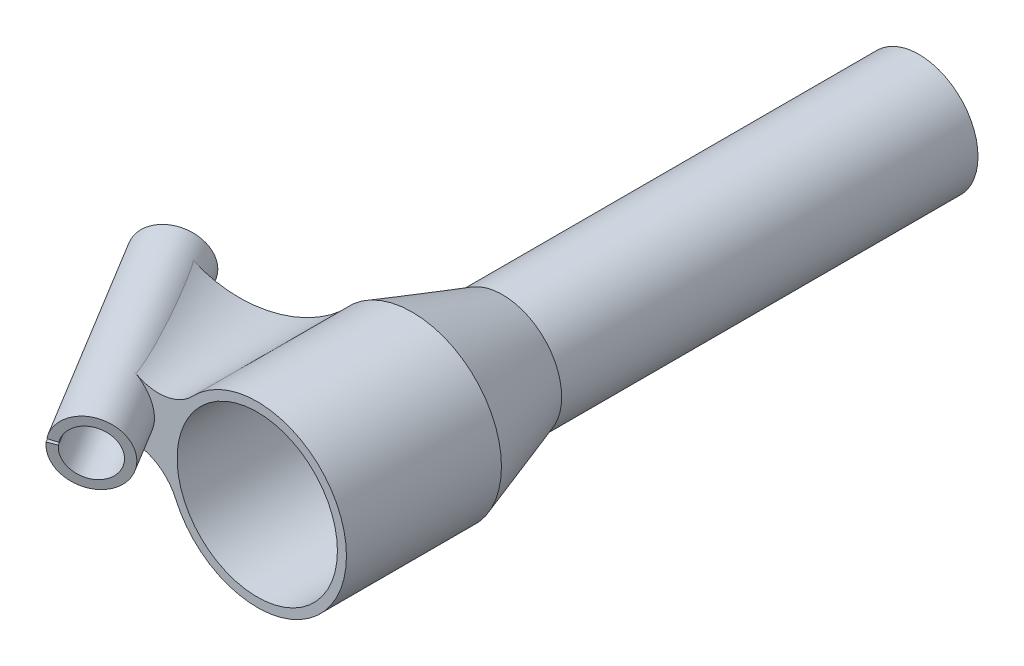
ISO-10303-21;
HEADER;
FILE_DESCRIPTION(('STEP AP214'),'2;1');
FILE_NAME('part.step','',(''),(''),'','','');
FILE_SCHEMA(('AUTOMOTIVE_DESIGN { 1 0 10303 214 1 1 1 1 }'));
ENDSEC;
DATA;
#1=APPLICATION_CONTEXT('core data for automotive mechanical design processes');
#2=APPLICATION_PROTOCOL_DEFINITION('international standard','automotive_design',2000,#1);
#3=PRODUCT_CONTEXT('',#1,'mechanical');
#4=PRODUCT('Part','Part','',(#3));
#5=PRODUCT_RELATED_PRODUCT_CATEGORY('part','',(#4));
#6=PRODUCT_DEFINITION_FORMATION('','',#4);
#7=PRODUCT_DEFINITION_CONTEXT('part definition',#1,'design');
#8=PRODUCT_DEFINITION('design','',#6,#7);
#9=PRODUCT_DEFINITION_SHAPE('','',#8);
#10=(LENGTH_UNIT() NAMED_UNIT(*) SI_UNIT(.MILLI.,.METRE.));
#11=(NAMED_UNIT(*) PLANE_ANGLE_UNIT() SI_UNIT($,.RADIAN.));
#12=(NAMED_UNIT(*) SI_UNIT($,.STERADIAN.) SOLID_ANGLE_UNIT());
#13=UNCERTAINTY_MEASURE_WITH_UNIT(LENGTH_MEASURE(1.E-05),#10,'distance_accuracy_value','');
#14=(GEOMETRIC_REPRESENTATION_CONTEXT(3) GLOBAL_UNCERTAINTY_ASSIGNED_CONTEXT((#13)) GLOBAL_UNIT_ASSIGNED_CONTEXT((#10,
#11,#12)) REPRESENTATION_CONTEXT('',''));
#15=CARTESIAN_POINT('',(0.,0.,0.));
#16=DIRECTION('',(0.,0.,1.));
#17=DIRECTION('',(1.,0.,0.));
#18=AXIS2_PLACEMENT_3D('',#15,#16,#17);
#19=CARTESIAN_POINT('',(-21.3575877374307,0.633698021464358,3.81273054215819));
#20=CARTESIAN_POINT('',(-14.683987017338,-0.896644228084365,17.));
#21=CARTESIAN_POINT('',(-20.8358609631164,0.859959942551472,3.67981004064208));
#22=CARTESIAN_POINT('',(-14.4189044379876,-0.855368175709342,17.));
#23=CARTESIAN_POINT('',(-20.2773212147006,1.04752006748351,3.53485155300601));
#24=CARTESIAN_POINT('',(-14.1433826197521,-0.833619817759401,17.));
#25=CARTESIAN_POINT('',(-19.1042223535504,1.31840552432742,3.22441051803164));
#26=CARTESIAN_POINT('',(-13.5814100552585,-0.834497384192288,17.));
#27=CARTESIAN_POINT('',(-18.4897041398732,1.40152699581741,3.05892933704576));
#28=CARTESIAN_POINT('',(-13.2949593090003,-0.857123308575115,17.));
#29=CARTESIAN_POINT('',(-17.2333468820839,1.44234478903316,2.71432910008326));
#30=CARTESIAN_POINT('',(-12.7210784382082,-0.952068333156142,17.));
#31=CARTESIAN_POINT('',(-16.5916679278792,1.39986734426265,2.53524575495671));
#32=CARTESIAN_POINT('',(-12.4340309661871,-1.02459199416444,17.));
#33=CARTESIAN_POINT('',(-15.3179205075513,1.1802374597193,2.17317933315417));
#34=CARTESIAN_POINT('',(-11.8721369115406,-1.21768763518036,17.));
#35=CARTESIAN_POINT('',(-14.686097283572,1.00302538721672,1.99026100965571));
#36=CARTESIAN_POINT('',(-11.5972903289152,-1.33825961518798,17.));
#37=CARTESIAN_POINT('',(-13.4709470755427,0.520427405898755,1.63156810432924));
#38=CARTESIAN_POINT('',(-11.0722130157059,-1.6253979157663,17.));
#39=CARTESIAN_POINT('',(-12.8878605954999,0.215137013462833,1.45586451543737));
#40=CARTESIAN_POINT('',(-10.8223949985682,-1.79173854416832,17.));
#41=CARTESIAN_POINT('',(-11.803355709349,-0.501815094100621,1.1218125761399));
#42=CARTESIAN_POINT('',(-10.3566285702611,-2.16061859172914,17.));
#43=CARTESIAN_POINT('',(-11.302078727206,-0.913263611710757,0.963513610207532));
#44=CARTESIAN_POINT('',(-10.1406801590917,-2.36315801088794,17.));
#45=CARTESIAN_POINT('',(-10.4025882567342,-1.81027823953436,0.671742080139232));
#46=CARTESIAN_POINT('',(-9.75108126975601,-2.79509147449339,17.));
#47=CARTESIAN_POINT('',(-10.0043779409748,-2.29560574341421,0.538281997625108));
#48=CARTESIAN_POINT('',(-9.57746504324554,-3.02405297426646,17.));
#49=CARTESIAN_POINT('',(-9.31838993621809,-3.30482919555537,0.299950325505213));
#50=CARTESIAN_POINT('',(-9.27348962190352,-3.4967186876267,17.));
#51=CARTESIAN_POINT('',(-9.03050762872951,-3.82854658962447,0.195058560589281));
#52=CARTESIAN_POINT('',(-9.14313042707197,-3.74042290121387,17.));
#53=CARTESIAN_POINT('',(-8.79535934711773,-4.35540210949988,0.104561651660663));
#54=CARTESIAN_POINT('',(-9.03484504576196,-3.98587506064481,17.));
#55=B_SPLINE_SURFACE_WITH_KNOTS('',3,1,((#19,#20),(#21,#22),(#23,#24),(#25,#26),(#27,#28),(#29,
#30),(#31,#32),(#33,#34),(#35,#36),(#37,#38),(#39,#40),(#41,#42),(#43,#44),(#45,#46),(#47,#48),
(#49,#50),(#51,#52),(#53,#54)),.UNSPECIFIED.,.F.,.F.,.F.,(4,2,2,2,2,2,2,2,4),(2,2),(0.,0.125,
0.25,0.375,0.5,0.625,0.75,0.875,1.),(0.,1.),.UNSPECIFIED.);
#56=CARTESIAN_POINT('',(-13.8707629595306,-6.11932223214418,17.));
#57=DIRECTION('',(0.,0.,-1.));
#58=DIRECTION('',(-1.,0.,0.));
#59=AXIS2_PLACEMENT_3D('',#56,#57,#58);
#60=CIRCLE('',#59,5.28561244344371);
#61=CARTESIAN_POINT('',(-14.683987017338,-0.896644228084365,17.));
#62=VERTEX_POINT('',#61);
#63=CARTESIAN_POINT('',(-9.03484504576196,-3.98587506064481,17.));
#64=VERTEX_POINT('',#63);
#65=EDGE_CURVE('E305',#62,#64,#60,.T.);
#66=CARTESIAN_POINT('',(-14.6839870173368,-0.896644228084656,17.0000000000025));
#67=CARTESIAN_POINT('',(-14.6833096345769,-0.89653885038281,17.0000005147996));
#68=CARTESIAN_POINT('',(-14.6826319208549,-0.896423925065205,16.9999515519792));
#69=CARTESIAN_POINT('',(-14.6812987528756,-0.896176345628803,16.9997433088099));
#70=CARTESIAN_POINT('',(-14.6806432598139,-0.896043724650004,16.9995842324017));
#71=CARTESIAN_POINT('',(-14.6787387919233,-0.895620328837586,16.9989240012649));
#72=CARTESIAN_POINT('',(-14.6775538317352,-0.895304320398823,16.9982397792249));
#73=CARTESIAN_POINT('',(-14.6752761239711,-0.894585498919072,16.9963460535506));
#74=CARTESIAN_POINT('',(-14.6742573517727,-0.894178579631031,16.9950554838133));
#75=CARTESIAN_POINT('',(-14.6719445734761,-0.893087070815295,16.991255791844));
#76=CARTESIAN_POINT('',(-14.6710062555261,-0.892420224660089,16.9885524889933));
#77=CARTESIAN_POINT('',(-14.6691966522356,-0.890755500264559,16.9813778561304));
#78=CARTESIAN_POINT('',(-14.6687105139977,-0.889801883201113,16.9768277781528));
#79=CARTESIAN_POINT('',(-14.6682634926754,-0.887964095042097,16.9676706709796));
#80=CARTESIAN_POINT('',(-14.6683064846804,-0.887080484041967,16.9630634687813));
#81=CARTESIAN_POINT('',(-14.6689404663162,-0.884227085165791,16.947796494647));
#82=CARTESIAN_POINT('',(-14.6701781868697,-0.882358238271274,16.9371508591288));
#83=CARTESIAN_POINT('',(-14.6732935023905,-0.878729470918932,16.9159320915969));
#84=CARTESIAN_POINT('',(-14.675172609621,-0.876969819617939,16.9053591917383));
#85=CARTESIAN_POINT('',(-14.679328631119,-0.873522655757762,16.8842869622885));
#86=CARTESIAN_POINT('',(-14.6816052163044,-0.871835084948702,16.8737875792521));
#87=CARTESIAN_POINT('',(-14.6864159152195,-0.868509583118143,16.8528565331742));
#88=CARTESIAN_POINT('',(-14.6889496989065,-0.866871591894926,16.8424248011704));
#89=CARTESIAN_POINT('',(-14.6967926663831,-0.862033753100477,16.811352488329));
#90=CARTESIAN_POINT('',(-14.7023780314482,-0.858884131716276,16.7907738071003));
#91=CARTESIAN_POINT('',(-14.7140035296533,-0.852667063773139,16.7497321836674));
#92=CARTESIAN_POINT('',(-14.7200437320058,-0.849599629817335,16.7292692595893));
#93=CARTESIAN_POINT('',(-14.7386494097393,-0.840476815463713,16.6679777744917));
#94=CARTESIAN_POINT('',(-14.7516905598197,-0.834506244287884,16.6272812708536));
#95=CARTESIAN_POINT('',(-14.7785063624901,-0.822699803892735,16.5461650807744));
#96=CARTESIAN_POINT('',(-14.7922802030083,-0.816863795411578,16.5057451416805));
#97=CARTESIAN_POINT('',(-14.820355313055,-0.805281827983421,16.4250960718656));
#98=CARTESIAN_POINT('',(-14.8346563525123,-0.799535831279117,16.3848668663594));
#99=CARTESIAN_POINT('',(-14.8781230690595,-0.782405041018454,16.2644768776261));
#100=CARTESIAN_POINT('',(-14.9078846665009,-0.771113673672471,16.1845183576079));
#101=CARTESIAN_POINT('',(-14.9684814275806,-0.748688823277761,16.0249857005847));
#102=CARTESIAN_POINT('',(-14.999316639472,-0.737555347357139,15.94541158104));
#103=CARTESIAN_POINT('',(-15.0930612710859,-0.704323822297415,15.7071008447505));
#104=CARTESIAN_POINT('',(-15.1571930827404,-0.682401016495542,15.5488207226027));
#105=CARTESIAN_POINT('',(-15.2877360232498,-0.638883912495943,15.2330995830573));
#106=CARTESIAN_POINT('',(-15.3541479246888,-0.617289729297851,15.0756588713833));
#107=CARTESIAN_POINT('',(-15.4887738726566,-0.574403857208613,14.761534363399));
#108=CARTESIAN_POINT('',(-15.5569876816302,-0.5531121290067,14.6048504705031));
#109=CARTESIAN_POINT('',(-15.7638112876265,-0.489689583232204,14.1359297914063));
#110=CARTESIAN_POINT('',(-15.9046833122008,-0.447985042618774,13.8246326804412));
#111=CARTESIAN_POINT('',(-16.1911336680287,-0.365713047436176,13.2040398244052));
#112=CARTESIAN_POINT('',(-16.3367123636683,-0.325145681362105,12.8947442365257));
#113=CARTESIAN_POINT('',(-16.6317869700799,-0.245196584357963,12.2779486398361));
#114=CARTESIAN_POINT('',(-16.7812821273131,-0.205814628439816,11.970448299337));
#115=CARTESIAN_POINT('',(-17.0837046293477,-0.128269533741429,11.3569978652814));
#116=CARTESIAN_POINT('',(-17.236631882484,-0.0901063624754313,11.0510477305886));
#117=CARTESIAN_POINT('',(-17.5408475110017,-0.0161941939414938,10.4499261148993));
#118=CARTESIAN_POINT('',(-17.6920422449584,0.0195929484158165,10.1547119009627));
#119=CARTESIAN_POINT('',(-17.9971541550771,0.0899293965904333,9.56554302468293));
#120=CARTESIAN_POINT('',(-18.1510713517045,0.124478693096662,9.27158837182882));
#121=CARTESIAN_POINT('',(-18.4615428504602,0.192263973805205,8.68492774540301));
#122=CARTESIAN_POINT('',(-18.6180971201771,0.225499974132131,8.39222175653963));
#123=CARTESIAN_POINT('',(-18.9338866840801,0.290543015493119,7.80809976789996));
#124=CARTESIAN_POINT('',(-19.0931219694258,0.322350061237791,7.51668376387403));
#125=CARTESIAN_POINT('',(-19.3626026862382,0.374315026876908,7.02921307472413));
#126=CARTESIAN_POINT('',(-19.4720548634016,0.394916536812497,6.83276692600762));
#127=CARTESIAN_POINT('',(-19.6924676128203,0.435259092950596,6.44063537596576));
#128=CARTESIAN_POINT('',(-19.8034281680439,0.455000148858228,6.24494996608267));
#129=CARTESIAN_POINT('',(-19.9897559435148,0.487010388998307,5.91979858442793));
#130=CARTESIAN_POINT('',(-20.0646172916767,0.499570611219422,5.79007153685656));
#131=CARTESIAN_POINT('',(-20.2153127675313,0.524131628968631,5.53113080365514));
#132=CARTESIAN_POINT('',(-20.2911468938568,0.536132425282944,5.40191711730384));
#133=CARTESIAN_POINT('',(-20.4691944977303,0.563273896020047,5.10171536575768));
#134=CARTESIAN_POINT('',(-20.5718741179016,0.578147742157589,4.93097765930691));
#135=CARTESIAN_POINT('',(-20.7456462979657,0.60124007567977,4.64853300087943));
#136=CARTESIAN_POINT('',(-20.8157572859132,0.610015324298854,4.53627134825222));
#137=CARTESIAN_POINT('',(-20.934619433342,0.623353294252596,4.350855391479));
#138=CARTESIAN_POINT('',(-20.9826189226933,0.628339861843105,4.27725370737928));
#139=CARTESIAN_POINT('',(-21.0642005380292,0.635645868208012,4.15593896600036));
#140=CARTESIAN_POINT('',(-21.0971945787452,0.63829798445849,4.10785433747714));
#141=CARTESIAN_POINT('',(-21.1534591669779,0.641915517475975,4.02881330350557));
#142=CARTESIAN_POINT('',(-21.1762630474354,0.643148182711897,3.99754119546337));
#143=CARTESIAN_POINT('',(-21.2153114169263,0.644549185757133,3.94632848136886));
#144=CARTESIAN_POINT('',(-21.2311830237004,0.644936038304183,3.92611360635662));
#145=CARTESIAN_POINT('',(-21.2584984204423,0.645040340473407,3.89318102150382));
#146=CARTESIAN_POINT('',(-21.2696432623365,0.644938696601926,3.8802214238355));
#147=CARTESIAN_POINT('',(-21.2889401716285,0.644311673467968,3.85927997309506));
#148=CARTESIAN_POINT('',(-21.2968531392506,0.643938653002924,3.85107748692121));
#149=CARTESIAN_POINT('',(-21.3106560374961,0.642923988943016,3.83798119293023));
#150=CARTESIAN_POINT('',(-21.3163555565077,0.64241101500363,3.83288633632638));
#151=CARTESIAN_POINT('',(-21.325256982123,0.641335392267976,3.82584460081664));
#152=CARTESIAN_POINT('',(-21.3282516463143,0.640931256714719,3.82361654831303));
#153=CARTESIAN_POINT('',(-21.3344220919699,0.639964060684078,3.81947460963396));
#154=CARTESIAN_POINT('',(-21.3375972133184,0.639401553001115,3.81755966667091));
#155=CARTESIAN_POINT('',(-21.3434999910031,0.638150064396229,3.81468708454539));
#156=CARTESIAN_POINT('',(-21.346177019594,0.637514302313592,3.81361213416414));
#157=CARTESIAN_POINT('',(-21.350994656633,0.636135962188615,3.81246080357126));
#158=CARTESIAN_POINT('',(-21.3530967138394,0.635462618559479,3.81219900535586));
#159=CARTESIAN_POINT('',(-21.3559640148895,0.634377585244837,3.81239923888241));
#160=CARTESIAN_POINT('',(-21.3567854846518,0.634046268309226,3.8125250647891));
#161=CARTESIAN_POINT('',(-21.3575877374307,0.633698021464358,3.81273054215819));
#162=B_SPLINE_CURVE_WITH_KNOTS('',3,(#66,#67,#68,#69,#70,#71,#72,#73,#74,#75,#76,#77,#78,#79,
#80,#81,#82,#83,#84,#85,#86,#87,#88,#89,#90,#91,#92,#93,#94,#95,#96,#97,#98,#99,#100,#101,#102,
#103,#104,#105,#106,#107,#108,#109,#110,#111,#112,#113,#114,#115,#116,#117,#118,#119,#120,#121,
#122,#123,#124,#125,#126,#127,#128,#129,#130,#131,#132,#133,#134,#135,#136,#137,#138,#139,#140,
#141,#142,#143,#144,#145,#146,#147,#148,#149,#150,#151,#152,#153,#154,#155,#156,#157,#158,#159,
#160,#161),.UNSPECIFIED.,.F.,.F.,(4,2,2,2,2,2,2,2,2,2,2,2,2,2,2,2,2,2,2,2,2,2,2,2,2,2,2,2,2,2,2,
2,2,2,2,2,2,2,2,2,2,2,2,2,2,2,2,4),(0.,0.00205705355248964,0.00411030740455365,
0.00822253345640406,0.0132146073804585,0.0219068107503364,0.0358660650164819,0.0499276104467232,
0.0824948613777941,0.115139436052746,0.147757110507623,0.180333446041185,0.244986407110505,
0.309649226374192,0.43908403549571,0.568378260146092,0.697616713271743,0.95578879199716,
1.21397248918976,1.73048464469141,2.24717357644492,2.76379472692419,3.79640995482804,
4.82910531916876,5.86160342836744,6.89407399412374,7.89487135984693,8.89567625198916,
9.89646885245799,10.8972581535288,11.5747160137562,12.2521662309089,12.7030718118788,
13.1539767591258,13.7533118663737,14.151227041545,14.4152371736476,14.5903424348968,
14.7064878567027,14.7835770214339,14.8348279610279,14.8690140350615,14.8919584417024,
14.9032110349845,14.9144248281674,14.9232268894807,14.9297710614318,14.9324497834166),.UNSPECIFIED.);
#163=CARTESIAN_POINT('',(-21.3575877374297,0.633698021464116,3.81273054216025));
#164=VERTEX_POINT('',#163);
#165=EDGE_CURVE('E205',#62,#164,#162,.T.);
#166=CARTESIAN_POINT('',(-17.681244562606,-8.70609177790614,2.34424287881773));
#167=DIRECTION('',(0.265640259417945,-0.0468395448977797,0.962933699488255));
#168=DIRECTION('',(-0.963991751594857,0.,0.265932139571506));
#169=AXIS2_PLACEMENT_3D('',#166,#167,#168);
#170=CIRCLE('',#169,10.1441425784977);
#171=CARTESIAN_POINT('',(-9.2481142616234,-3.46237017635689,0.272900491973125));
#172=VERTEX_POINT('',#171);
#173=EDGE_CURVE('E335',#172,#164,#170,.T.);
#174=CARTESIAN_POINT('',(-9.03484504576196,-3.98587506064481,17.));
#175=CARTESIAN_POINT('',(-9.03555124928396,-3.98427433699155,17.000012805153));
#176=CARTESIAN_POINT('',(-9.03622862057589,-3.98273775211461,16.9996773547566));
#177=CARTESIAN_POINT('',(-9.03770681492541,-3.97938244390029,16.9983396717478));
#178=CARTESIAN_POINT('',(-9.03848397186105,-3.97761677980426,16.997168026878));
#179=CARTESIAN_POINT('',(-9.04047571961812,-3.97308879059006,16.9933241176221));
#180=CARTESIAN_POINT('',(-9.04152821458961,-3.97069242359235,16.9902082734842));
#181=CARTESIAN_POINT('',(-9.04407729661022,-3.96488415471948,16.9813080970583));
#182=CARTESIAN_POINT('',(-9.04536001287796,-3.96195608053107,16.9751975197101));
#183=CARTESIAN_POINT('',(-9.04765596733559,-3.95671001494612,16.9626476930363));
#184=CARTESIAN_POINT('',(-9.04866725692749,-3.95439643624192,16.9562064429341));
#185=CARTESIAN_POINT('',(-9.05070156964881,-3.94973845040568,16.9419464645801));
#186=CARTESIAN_POINT('',(-9.05169050818354,-3.9474712652573,16.9340979894712));
#187=CARTESIAN_POINT('',(-9.05352787532859,-3.94325539888562,16.9182984420906));
#188=CARTESIAN_POINT('',(-9.05437621476025,-3.94130691982015,16.9103473081244));
#189=CARTESIAN_POINT('',(-9.05677982296039,-3.93578209385609,16.8863796836763));
#190=CARTESIAN_POINT('',(-9.05819054892718,-3.93253354023937,16.8702737879489));
#191=CARTESIAN_POINT('',(-9.06079292424214,-3.92653370085804,16.8379797226559));
#192=CARTESIAN_POINT('',(-9.06198485831286,-3.92378176889994,16.8217916885967));
#193=CARTESIAN_POINT('',(-9.06421949295347,-3.91861683204985,16.7893708077852));
#194=CARTESIAN_POINT('',(-9.06526236389694,-3.9162034402788,16.7731380341618));
#195=CARTESIAN_POINT('',(-9.06822063489275,-3.90935089634458,16.7245998405629));
#196=CARTESIAN_POINT('',(-9.06998187671124,-3.90526201245881,16.6922362655119));
#197=CARTESIAN_POINT('',(-9.07325260012768,-3.89765684692302,16.6274279745547));
#198=CARTESIAN_POINT('',(-9.07476205076957,-3.89414063568059,16.5949832491685));
#199=CARTESIAN_POINT('',(-9.07903395841246,-3.88417566700305,16.4975309244135));
#200=CARTESIAN_POINT('',(-9.08153740357911,-3.87831653572407,16.4324521883477));
#201=CARTESIAN_POINT('',(-9.08615054185665,-3.86749618594238,16.3022631633205));
#202=CARTESIAN_POINT('',(-9.08826054943453,-3.86253425042552,16.237152941624));
#203=CARTESIAN_POINT('',(-9.09221253120222,-3.85322226234022,16.1069043637876));
#204=CARTESIAN_POINT('',(-9.09405460136123,-3.84887199070612,16.0417660261443));
#205=CARTESIAN_POINT('',(-9.09929311249016,-3.83647900431961,15.8464589997294));
#206=CARTESIAN_POINT('',(-9.10240694757589,-3.82908214103635,15.716242307209));
#207=CARTESIAN_POINT('',(-9.1081795441421,-3.81533017475622,15.4557428615065));
#208=CARTESIAN_POINT('',(-9.11083829408403,-3.80897509817373,15.3254601067333));
#209=CARTESIAN_POINT('',(-9.11835446648362,-3.79096416622809,14.9345034951141));
#210=CARTESIAN_POINT('',(-9.12275058454824,-3.78036552356855,14.6737725054087));
#211=CARTESIAN_POINT('',(-9.1308644115713,-3.76072455500859,14.1522118502829));
#212=CARTESIAN_POINT('',(-9.13458203477052,-3.75168242585388,13.8913821765585));
#213=CARTESIAN_POINT('',(-9.14156434939976,-3.73463665259865,13.3697047750198));
#214=CARTESIAN_POINT('',(-9.144829078624,-3.7266329218469,13.1088570505316));
#215=CARTESIAN_POINT('',(-9.15418095270983,-3.7036297793616,12.3241527156124));
#216=CARTESIAN_POINT('',(-9.15979537389429,-3.68971234845334,11.8002592255882));
#217=CARTESIAN_POINT('',(-9.17030442280596,-3.66351425234824,10.7524091512062));
#218=CARTESIAN_POINT('',(-9.17519902778602,-3.65123363887819,10.2284525653779));
#219=CARTESIAN_POINT('',(-9.18450522129588,-3.62776078935247,9.18058421898254));
#220=CARTESIAN_POINT('',(-9.18891687731661,-3.61656840124452,8.65667246240206));
#221=CARTESIAN_POINT('',(-9.1973966876382,-3.59494832487964,7.60883563949249));
#222=CARTESIAN_POINT('',(-9.20146484525126,-3.58452062924926,7.08491057334049));
#223=CARTESIAN_POINT('',(-9.2093410145221,-3.56423643710706,6.03701547157483));
#224=CARTESIAN_POINT('',(-9.21314901027826,-3.55437997551581,5.51304543516885));
#225=CARTESIAN_POINT('',(-9.22055935913035,-3.53511194926927,4.46509404125408));
#226=CARTESIAN_POINT('',(-9.22416171154953,-3.52570038607811,3.9411126837137));
#227=CARTESIAN_POINT('',(-9.23119922348339,-3.50723305294247,2.89308013462641));
#228=CARTESIAN_POINT('',(-9.23463436302263,-3.49817732553131,2.36902894219865));
#229=CARTESIAN_POINT('',(-9.24136255067154,-3.48036392928466,1.32092247875146));
#230=CARTESIAN_POINT('',(-9.2446555992978,-3.47160625936558,0.796867207753782));
#231=CARTESIAN_POINT('',(-9.24789039518241,-3.46296812556695,0.272809649157695));
#232=B_SPLINE_CURVE_WITH_KNOTS('',3,(#174,#175,#176,#177,#178,#179,#180,#181,#182,#183,#184,
#185,#186,#187,#188,#189,#190,#191,#192,#193,#194,#195,#196,#197,#198,#199,#200,#201,#202,#203,
#204,#205,#206,#207,#208,#209,#210,#211,#212,#213,#214,#215,#216,#217,#218,#219,#220,#221,#222,
#223,#224,#225,#226,#227,#228,#229,#230,#231),.UNSPECIFIED.,.F.,.F.,(4,2,2,2,2,2,2,2,2,2,2,2,2,
2,2,2,2,2,2,2,2,2,2,2,2,2,2,2,4),(0.,0.0051043895513909,0.0117353636084539,0.023789698444097,
0.0443866786099016,0.0651277945227576,0.0897989297350008,0.114485653863565,0.163937028495885,
0.213323586673136,0.26265323859055,0.360646788124654,0.458652376458069,0.654805873280934,
0.850801910015572,1.04672757155133,1.43810935409454,1.82950105854139,2.6124383918584,
3.39547461711148,4.1784454582589,5.75076436331212,7.32313294508229,8.8952815109849,
10.4674149156507,12.0396443265354,13.6118789112114,15.1843008581927,16.7567170880193),.UNSPECIFIED.);
#233=EDGE_CURVE('E271',#64,#172,#232,.T.);
#234=ORIENTED_EDGE('',*,*,#65,.F.);
#235=ORIENTED_EDGE('',*,*,#165,.T.);
#236=ORIENTED_EDGE('',*,*,#173,.F.);
#237=ORIENTED_EDGE('',*,*,#233,.F.);
#238=EDGE_LOOP('',(#234,#235,#236,#237));
#239=FACE_BOUND('',#238,.T.);
#240=ADVANCED_FACE('F86',(#239),#55,.T.);
#241=CARTESIAN_POINT('',(-6.77529902191482,7.10092928735438,0.104561651660665));
#242=CARTESIAN_POINT('',(-7.12672765992668,6.83559637933924,17.));
#243=CARTESIAN_POINT('',(-7.17646132735561,6.68627249208677,0.195058560589282));
#244=CARTESIAN_POINT('',(-7.31243221643085,6.64198257800174,17.));
#245=CARTESIAN_POINT('',(-7.62610410553911,6.29260066957099,0.299950325505214));
#246=CARTESIAN_POINT('',(-7.51828153992581,6.45756099733955,17.));
#247=CARTESIAN_POINT('',(-8.61589672130559,5.57886255457645,0.538281997625109));
#248=CARTESIAN_POINT('',(-7.9655861952898,6.1173662315713,17.));
#249=CARTESIAN_POINT('',(-9.1560837989824,5.25899982978589,0.671742080139233));
#250=CARTESIAN_POINT('',(-8.20704152715882,5.96159304646525,17.));
#251=CARTESIAN_POINT('',(-10.3081254281255,4.72372566291389,0.963513610207534));
#252=CARTESIAN_POINT('',(-8.72087467366345,5.68895902601483,17.));
#253=CARTESIAN_POINT('',(-10.9198953901792,4.50853735236073,1.1218125761399));
#254=CARTESIAN_POINT('',(-8.99307236327952,5.57249293495213,17.));
#255=CARTESIAN_POINT('',(-12.184208691488,4.20574526402518,1.45586451543737));
#256=CARTESIAN_POINT('',(-9.55691404570624,5.38516057686995,17.));
#257=CARTESIAN_POINT('',(-12.8365462178411,4.11829345653179,1.63156810432925));
#258=CARTESIAN_POINT('',(-9.8485580385169,5.31429430985047,17.));
#259=CARTESIAN_POINT('',(-14.1434721322117,4.08040554299353,1.99026100965571));
#260=CARTESIAN_POINT('',(-10.4401763977998,5.2240595855729,17.));
#261=CARTESIAN_POINT('',(-14.7978018518626,4.12997693577059,2.17317933315418));
#262=CARTESIAN_POINT('',(-10.7396857492244,5.2047620532683,17.));
#263=CARTESIAN_POINT('',(-16.0698507480799,4.35923962922238,2.53524575495672));
#264=CARTESIAN_POINT('',(-11.333736044855,5.21549058940375,17.));
#265=CARTESIAN_POINT('',(-16.6873598680082,4.53879101570784,2.71432910008327));
#266=CARTESIAN_POINT('',(-11.628276989061,5.24551665784381,17.));
#267=CARTESIAN_POINT('',(-17.8539890047378,5.0068466841668,3.05892933704576));
#268=CARTESIAN_POINT('',(-12.2000217194698,5.35257633654486,17.));
#269=CARTESIAN_POINT('',(-18.4030180178763,5.29513292507291,3.22441051803165));
#270=CARTESIAN_POINT('',(-12.4769358938476,5.42928684765484,17.));
#271=CARTESIAN_POINT('',(-19.4127220783769,5.95090543057311,3.53485155300601));
#272=CARTESIAN_POINT('',(-13.0053175111836,5.62066814200681,17.));
#273=CARTESIAN_POINT('',(-19.8734284175674,6.31818614073169,3.67981004064208));
#274=CARTESIAN_POINT('',(-13.2567849541418,5.73533892524881,17.));
#275=CARTESIAN_POINT('',(-20.2863050827777,6.70924386446993,3.81273054215819));
#276=CARTESIAN_POINT('',(-13.4917638565071,5.86478930886338,17.));
#277=B_SPLINE_SURFACE_WITH_KNOTS('',3,1,((#241,#242),(#243,#244),(#245,#246),(#247,#248),(#249,
#250),(#251,#252),(#253,#254),(#255,#256),(#257,#258),(#259,#260),(#261,#262),(#263,#264),(#265,
#266),(#267,#268),(#269,#270),(#271,#272),(#273,#274),(#275,#276)),.UNSPECIFIED.,.F.,.F.,.F.,(4,
2,2,2,2,2,2,2,4),(2,2),(0.,0.125,0.25,0.375,0.5,0.625,0.75,0.875,1.),(0.,1.),.UNSPECIFIED.);
#278=CARTESIAN_POINT('',(-13.6372762841059,14.228391999062,2.34424287881773));
#279=DIRECTION('',(0.265640259417945,-0.0468395448977797,0.962933699488255));
#280=DIRECTION('',(-0.963991751594857,0.,0.265932139571506));
#281=AXIS2_PLACEMENT_3D('',#278,#279,#280);
#282=CIRCLE('',#281,10.1441425784977);
#283=CARTESIAN_POINT('',(-20.2863050827777,6.70924386446993,3.81273054215819));
#284=VERTEX_POINT('',#283);
#285=CARTESIAN_POINT('',(-7.50593526738699,6.41689647068539,0.272845943762579));
#286=VERTEX_POINT('',#285);
#287=EDGE_CURVE('E327',#284,#286,#282,.T.);
#288=CARTESIAN_POINT('',(-20.2863050827778,6.70924386446994,3.81273054215803));
#289=CARTESIAN_POINT('',(-20.2847592380986,6.7077935044939,3.81227067736124));
#290=CARTESIAN_POINT('',(-20.2831453611308,6.70643483050747,3.81221590466666));
#291=CARTESIAN_POINT('',(-20.2790149983236,6.70322275835533,3.81280075072131));
#292=CARTESIAN_POINT('',(-20.2764613863428,6.70147454667346,3.81381218855733));
#293=CARTESIAN_POINT('',(-20.2703360130604,6.69753238603535,3.81692466123508));
#294=CARTESIAN_POINT('',(-20.2668459261124,6.69551174792934,3.81931397933045));
#295=CARTESIAN_POINT('',(-20.2600290543751,6.69177430569509,3.82455174829591));
#296=CARTESIAN_POINT('',(-20.2567030741508,6.69005890813544,3.82740221470219));
#297=CARTESIAN_POINT('',(-20.2461357873479,6.68481431648778,3.8370187366743));
#298=CARTESIAN_POINT('',(-20.2391506063928,6.6816719784036,3.84425935377143));
#299=CARTESIAN_POINT('',(-20.2254945979577,6.67581870291725,3.85920252247386));
#300=CARTESIAN_POINT('',(-20.2188245854742,6.67310884502791,3.8669061659061));
#301=CARTESIAN_POINT('',(-20.2056894745357,6.66796458749379,3.88259783656166));
#302=CARTESIAN_POINT('',(-20.1992246940169,6.66553060153027,3.89058626786111));
#303=CARTESIAN_POINT('',(-20.1864551079853,6.66085546153611,3.90672400065974));
#304=CARTESIAN_POINT('',(-20.1801500956306,6.65861404814274,3.91487306701737));
#305=CARTESIAN_POINT('',(-20.161525401353,6.65213983635448,3.93934100803051));
#306=CARTESIAN_POINT('',(-20.1493688265813,6.64810894794134,3.95583728750845));
#307=CARTESIAN_POINT('',(-20.12533541986,6.64038627541908,3.98911155913699));
#308=CARTESIAN_POINT('',(-20.1134586419387,6.63669455641034,4.005889604642));
#309=CARTESIAN_POINT('',(-20.0781040331839,6.62596936788838,4.05654037023558));
#310=CARTESIAN_POINT('',(-20.0549257393534,6.61929378530028,4.09069746174994));
#311=CARTESIAN_POINT('',(-20.0090997357734,6.60652123569518,4.15935713423406));
#312=CARTESIAN_POINT('',(-19.9864509831738,6.60042304371565,4.19385880392941));
#313=CARTESIAN_POINT('',(-19.9415042867525,6.58862708088029,4.26313159528377));
#314=CARTESIAN_POINT('',(-19.9192061673802,6.58292910435234,4.29790256819401));
#315=CARTESIAN_POINT('',(-19.8527546858596,6.56629032165027,4.40241559780636));
#316=CARTESIAN_POINT('',(-19.808974498138,6.5557857995903,4.47246371837385));
#317=CARTESIAN_POINT('',(-19.7220595589479,6.5355326717292,4.61306927521134));
#318=CARTESIAN_POINT('',(-19.6789248407359,6.52578410476963,4.68362673744836));
#319=CARTESIAN_POINT('',(-19.5501955628068,6.49735714026939,4.8958812141307));
#320=CARTESIAN_POINT('',(-19.4653043168468,6.47950433812623,5.03811489644763));
#321=CARTESIAN_POINT('',(-19.2966650431188,6.44520236197527,5.32354559798238));
#322=CARTESIAN_POINT('',(-19.2129177887074,6.42875410149105,5.46674317979308));
#323=CARTESIAN_POINT('',(-19.0463468839117,6.3969416064566,5.7537648697621));
#324=CARTESIAN_POINT('',(-18.9635230973402,6.38157721023593,5.89758888106901));
#325=CARTESIAN_POINT('',(-18.7162838777174,6.3368140796553,6.32959078302865));
#326=CARTESIAN_POINT('',(-18.5529643448184,6.30871834172896,6.6185307895044));
#327=CARTESIAN_POINT('',(-18.228598968488,6.25520032110894,7.19795227795974));
#328=CARTESIAN_POINT('',(-18.0675532874479,6.22977822853093,7.48843386801651));
#329=CARTESIAN_POINT('',(-17.7475765394383,6.18127655663572,8.07063114047377));
#330=CARTESIAN_POINT('',(-17.5886448074597,6.15819622473822,8.3623463948119));
#331=CARTESIAN_POINT('',(-17.2727949080205,6.1141978113222,8.94701788431951));
#332=CARTESIAN_POINT('',(-17.1158766930028,6.09327967865218,9.23997408996085));
#333=CARTESIAN_POINT('',(-16.7996398131243,6.05296694091463,9.83556355594109));
#334=CARTESIAN_POINT('',(-16.6403816535977,6.03363335144262,10.1382330845334));
#335=CARTESIAN_POINT('',(-16.3242386783409,5.99717950883613,10.7449458585557));
#336=CARTESIAN_POINT('',(-16.167353882356,5.98005927410672,11.0489891153871));
#337=CARTESIAN_POINT('',(-15.8562454220669,5.94808678626318,11.6585566356624));
#338=CARTESIAN_POINT('',(-15.702021776997,5.93323454953568,11.9640809097904));
#339=CARTESIAN_POINT('',(-15.3966561070536,5.90590705242343,12.5767737524511));
#340=CARTESIAN_POINT('',(-15.2455140718807,5.89343178409318,12.883942315484));
#341=CARTESIAN_POINT('',(-14.9882349816727,5.87414420330745,13.4149547208435));
#342=CARTESIAN_POINT('',(-14.8812122476992,5.86671994362667,13.6383472800732));
#343=CARTESIAN_POINT('',(-14.6694645715334,5.85333237717816,14.0862597888623));
#344=CARTESIAN_POINT('',(-14.5647395807553,5.84736903949213,14.31077971446));
#345=CARTESIAN_POINT('',(-14.3957152036163,5.83897219434147,14.6792139312467));
#346=CARTESIAN_POINT('',(-14.330572532301,5.83604385631313,14.8227299512071));
#347=CARTESIAN_POINT('',(-14.2016595164805,5.83095665178981,15.1103900022832));
#348=CARTESIAN_POINT('',(-14.13788916605,5.82879778197174,15.2545340306839));
#349=CARTESIAN_POINT('',(-13.9945363654564,5.82491824982151,15.5837488714341));
#350=CARTESIAN_POINT('',(-13.9154866438501,5.82348626064706,15.7690571738247));
#351=CARTESIAN_POINT('',(-13.7892135067572,5.82300619027955,16.0747167413307));
#352=CARTESIAN_POINT('',(-13.7407374703694,5.82328765921762,16.194545800402));
#353=CARTESIAN_POINT('',(-13.6634457824039,5.82507097576722,16.3924840089147));
#354=CARTESIAN_POINT('',(-13.633774393871,5.82610272491514,16.470259667871));
#355=CARTESIAN_POINT('',(-13.5866739853859,5.82879578308916,16.5989479291075));
#356=CARTESIAN_POINT('',(-13.5686249940169,5.83010562818731,16.6496379148059));
#357=CARTESIAN_POINT('',(-13.5401911678136,5.83304060582058,16.7336793123097));
#358=CARTESIAN_POINT('',(-13.5293378895642,5.83439418667276,16.7668787189703));
#359=CARTESIAN_POINT('',(-13.5124439401953,5.83724462346014,16.8220557798058));
#360=CARTESIAN_POINT('',(-13.5060399367963,5.83852885527272,16.8439307004424));
#361=CARTESIAN_POINT('',(-13.4962562773664,5.84114616873996,16.8803976528237));
#362=CARTESIAN_POINT('',(-13.4925912784748,5.84231237173194,16.8949221597149));
#363=CARTESIAN_POINT('',(-13.4871680574349,5.84464618235207,16.9192234494616));
#364=CARTESIAN_POINT('',(-13.4851823900873,5.84568241304816,16.9289605208554));
#365=CARTESIAN_POINT('',(-13.4824110689752,5.84773318443612,16.9453326826976));
#366=CARTESIAN_POINT('',(-13.4814451794173,5.84864509047904,16.951946289495));
#367=CARTESIAN_POINT('',(-13.4802941341298,5.8504470754272,16.9631140057724));
#368=CARTESIAN_POINT('',(-13.4799593927841,5.85125513363054,16.9676666484846));
#369=CARTESIAN_POINT('',(-13.4797464922324,5.85313590553654,16.9768391252265));
#370=CARTESIAN_POINT('',(-13.4798760953036,5.8542128359738,16.9814588036419));
#371=CARTESIAN_POINT('',(-13.4809580033076,5.85626713547021,16.9881651257799));
#372=CARTESIAN_POINT('',(-13.4814697778413,5.85702834788098,16.9903703759424));
#373=CARTESIAN_POINT('',(-13.4828854445056,5.85859421914966,16.9939890304575));
#374=CARTESIAN_POINT('',(-13.4836649842727,5.85934411342074,16.9954651322671));
#375=CARTESIAN_POINT('',(-13.4854528321929,5.86079275224111,16.9976022397986));
#376=CARTESIAN_POINT('',(-13.4863476345982,5.86145339132279,16.9983754789191));
#377=CARTESIAN_POINT('',(-13.4883660539589,5.86280534314075,16.9994824880752));
#378=CARTESIAN_POINT('',(-13.4894902637698,5.86349673164684,16.9998151023766));
#379=CARTESIAN_POINT('',(-13.4910148921906,5.86437285234951,16.9999822208526));
#380=CARTESIAN_POINT('',(-13.4913892818484,5.86458328906269,17.0000015449338));
#381=CARTESIAN_POINT('',(-13.4917638565071,5.86478930886338,17.));
#382=B_SPLINE_CURVE_WITH_KNOTS('',3,(#288,#289,#290,#291,#292,#293,#294,#295,#296,#297,#298,
#299,#300,#301,#302,#303,#304,#305,#306,#307,#308,#309,#310,#311,#312,#313,#314,#315,#316,#317,
#318,#319,#320,#321,#322,#323,#324,#325,#326,#327,#328,#329,#330,#331,#332,#333,#334,#335,#336,
#337,#338,#339,#340,#341,#342,#343,#344,#345,#346,#347,#348,#349,#350,#351,#352,#353,#354,#355,
#356,#357,#358,#359,#360,#361,#362,#363,#364,#365,#366,#367,#368,#369,#370,#371,#372,#373,#374,
#375,#376,#377,#378,#379,#380,#381),.UNSPECIFIED.,.F.,.F.,(4,2,2,2,2,2,2,2,2,2,2,2,2,2,2,2,2,2,
2,2,2,2,2,2,2,2,2,2,2,2,2,2,2,2,2,2,2,2,2,2,2,2,2,2,2,2,4),(0.,0.00631192127778467,
0.0158717951470556,0.0298977759270318,0.0439868038307389,0.0755368023012499,0.107164360882152,
0.138838735767635,0.17046975906955,0.23310990019406,0.295762039496435,0.421188846467739,
0.546343294389495,0.671432947151449,0.921227688047869,1.17103525509361,1.6708124371585,
2.17091224042418,2.670937289809,3.67017563702679,4.66948498940189,5.66847216597025,
6.66743570392769,7.69509160220321,8.72275604536271,9.75042791319846,10.7780963457707,
11.5215332464574,12.2649544120215,12.7378534835092,13.2107505126585,13.8151144690822,
14.2028756925878,14.4526017237587,14.614052393082,14.7188977672476,14.7873691230104,
14.8324259980432,14.8623871364655,14.8826002461,14.8965045688365,14.9106424015669,
14.9177591630892,14.9231593632153,14.9271442219722,14.9311395122314,14.932426104865),.UNSPECIFIED.);
#383=CARTESIAN_POINT('',(-13.491763856507,5.86478930886337,17.0000000000002));
#384=VERTEX_POINT('',#383);
#385=EDGE_CURVE('E201',#284,#384,#382,.T.);
#386=CARTESIAN_POINT('',(-10.9413221308475,10.4943622812121,17.));
#387=DIRECTION('',(0.,0.,-1.));
#388=DIRECTION('',(1.,0.,0.));
#389=AXIS2_PLACEMENT_3D('',#386,#387,#388);
#390=CIRCLE('',#389,5.28561244344372);
#391=CARTESIAN_POINT('',(-7.12672765992668,6.83559637933924,17.));
#392=VERTEX_POINT('',#391);
#393=EDGE_CURVE('E91',#392,#384,#390,.T.);
#394=CARTESIAN_POINT('',(-7.50576950755116,6.41709039203244,0.272809649157698));
#395=CARTESIAN_POINT('',(-7.49949955997928,6.42442380468166,0.820969131451953));
#396=CARTESIAN_POINT('',(-7.49312515073376,6.4318581438376,1.36912610557775));
#397=CARTESIAN_POINT('',(-7.48011656453362,6.44698235312224,2.46543374544056));
#398=CARTESIAN_POINT('',(-7.47348238743341,6.45467222339417,3.01358441117386));
#399=CARTESIAN_POINT('',(-7.45990329999417,6.47036131275456,4.10988786841522));
#400=CARTESIAN_POINT('',(-7.45295838379555,6.47836053767611,4.6580406597683));
#401=CARTESIAN_POINT('',(-7.43867594568259,6.49475500945837,5.75433504367982));
#402=CARTESIAN_POINT('',(-7.43133842384146,6.50315025624522,6.30247663624034));
#403=CARTESIAN_POINT('',(-7.41204376696549,6.52514770771044,7.69679745097063));
#404=CARTESIAN_POINT('',(-7.39974418265821,6.53909899508441,8.54296674524591));
#405=CARTESIAN_POINT('',(-7.37981401892071,6.56155989806287,9.81216792019215));
#406=CARTESIAN_POINT('',(-7.37292385584409,6.56930250237651,10.2352249247799));
#407=CARTESIAN_POINT('',(-7.35845537231131,6.58550521339657,11.0813139687542));
#408=CARTESIAN_POINT('',(-7.35087705165782,6.59396532030872,11.5043460081335));
#409=CARTESIAN_POINT('',(-7.33743411366286,6.60891437817917,12.2075906031989));
#410=CARTESIAN_POINT('',(-7.33185443119109,6.61510483446824,12.4878148958411));
#411=CARTESIAN_POINT('',(-7.32008529759775,6.62812597177446,13.0482355723323));
#412=CARTESIAN_POINT('',(-7.31389584784072,6.63495665135893,13.3284319562424));
#413=CARTESIAN_POINT('',(-7.30282618343578,6.6471345890559,13.7961004665138));
#414=CARTESIAN_POINT('',(-7.29819015714245,6.65222511252664,13.9835849246237));
#415=CARTESIAN_POINT('',(-7.28837528129837,6.6629770530465,14.3585230284152));
#416=CARTESIAN_POINT('',(-7.28319643221691,6.66863846960203,14.5459766741233));
#417=CARTESIAN_POINT('',(-7.27020607576496,6.68280285233523,14.9843236571941));
#418=CARTESIAN_POINT('',(-7.26209700339383,6.69161877453218,15.2351989881117));
#419=CARTESIAN_POINT('',(-7.24644112821953,6.70856187093281,15.6538944914566));
#420=CARTESIAN_POINT('',(-7.23959383268146,6.71595415933961,15.8217684403845));
#421=CARTESIAN_POINT('',(-7.22636505660608,6.73018087511239,16.1019329766047));
#422=CARTESIAN_POINT('',(-7.22057581219002,6.73639407303494,16.2142807233197));
#423=CARTESIAN_POINT('',(-7.20940276379136,6.74834649581586,16.4017678766242));
#424=CARTESIAN_POINT('',(-7.20451412085665,6.75356709915868,16.4769674971295));
#425=CARTESIAN_POINT('',(-7.195092392772,6.76360121460033,16.6024492453982));
#426=CARTESIAN_POINT('',(-7.19097094107945,6.76798414749918,16.6527941778382));
#427=CARTESIAN_POINT('',(-7.18303747268824,6.7764016647818,16.7367861658175));
#428=CARTESIAN_POINT('',(-7.1795666361148,6.78007974177232,16.7704987748702));
#429=CARTESIAN_POINT('',(-7.17289122397303,6.78714019294262,16.8267253618705));
#430=CARTESIAN_POINT('',(-7.16996877956409,6.79022800583609,16.8493068979684));
#431=CARTESIAN_POINT('',(-7.16434578409074,6.79615960880284,16.8869437367544));
#432=CARTESIAN_POINT('',(-7.16187935274379,6.79875912871595,16.9020703049223));
#433=CARTESIAN_POINT('',(-7.15713075696622,6.80375722007359,16.9272605394446));
#434=CARTESIAN_POINT('',(-7.15504185325923,6.80595425714926,16.9373964877439));
#435=CARTESIAN_POINT('',(-7.15100070449638,6.81019966547263,16.9542284810979));
#436=CARTESIAN_POINT('',(-7.14921146957507,6.81207813706261,16.9610053829173));
#437=CARTESIAN_POINT('',(-7.14530743251121,6.81617300983772,16.9736691207068));
#438=CARTESIAN_POINT('',(-7.14323609162025,6.81834412893589,16.9795813375095));
#439=CARTESIAN_POINT('',(-7.1392272197312,6.82254089234585,16.9882648211615));
#440=CARTESIAN_POINT('',(-7.13760172338795,6.82424167232314,16.9913091215224));
#441=CARTESIAN_POINT('',(-7.13448136604256,6.82750346921323,16.9955730609224));
#442=CARTESIAN_POINT('',(-7.13317036732326,6.82887327443182,16.9970470105788));
#443=CARTESIAN_POINT('',(-7.13062393009867,6.83153201433425,16.9989469122741));
#444=CARTESIAN_POINT('',(-7.12945777036259,6.83274906306773,16.9995458439495));
#445=CARTESIAN_POINT('',(-7.12775293798457,6.83452731721859,16.999943123772));
#446=CARTESIAN_POINT('',(-7.12724132486932,6.83506084538837,17.0000041384652));
#447=CARTESIAN_POINT('',(-7.12672765992668,6.83559637933924,17.));
#448=B_SPLINE_CURVE_WITH_KNOTS('',3,(#394,#395,#396,#397,#398,#399,#400,#401,#402,#403,#404,
#405,#406,#407,#408,#409,#410,#411,#412,#413,#414,#415,#416,#417,#418,#419,#420,#421,#422,#423,
#424,#425,#426,#427,#428,#429,#430,#431,#432,#433,#434,#435,#436,#437,#438,#439,#440,#441,#442,
#443,#444,#445,#446,#447),.UNSPECIFIED.,.F.,.F.,(4,2,2,2,2,2,2,2,2,2,2,2,2,2,2,2,2,2,2,2,2,2,2,
2,2,2,4),(0.,1.64473319345433,3.28946730882515,4.93423245195483,6.578997288345,9.11811469677734,
10.3876658423825,11.6572173520107,12.4982610238333,13.3393028136245,13.9021339393911,
14.4649645785543,15.2184328709608,15.7229456479738,16.0609337911569,16.2875336346383,
16.4396248812964,16.5418764340532,16.6107906204584,16.6574085145506,16.6891199362625,
16.7108749592132,16.7306832186588,16.7421369367166,16.7492508899964,16.7545116876756,
16.7567306367435),.UNSPECIFIED.);
#449=EDGE_CURVE('E354',#286,#392,#448,.T.);
#450=ORIENTED_EDGE('',*,*,#287,.F.);
#451=ORIENTED_EDGE('',*,*,#385,.T.);
#452=ORIENTED_EDGE('',*,*,#393,.F.);
#453=ORIENTED_EDGE('',*,*,#449,.F.);
#454=EDGE_LOOP('',(#450,#451,#452,#453));
#455=FACE_BOUND('',#454,.T.);
#456=ADVANCED_FACE('F215',(#455),#277,.T.);
#457=CARTESIAN_POINT('',(0.,0.,-83.5827742070717));
#458=DIRECTION('',(0.,0.,1.));
#459=DIRECTION('',(1.,0.,0.));
#460=AXIS2_PLACEMENT_3D('',#457,#458,#459);
#461=CYLINDRICAL_SURFACE('',#460,9.87499999999999);
#462=CARTESIAN_POINT('',(0.,0.,17.));
#463=DIRECTION('',(0.,0.,1.));
#464=DIRECTION('',(1.,0.,0.));
#465=AXIS2_PLACEMENT_3D('',#462,#463,#464);
#466=CIRCLE('',#465,9.87499999999999);
#467=EDGE_CURVE('E293',#64,#392,#466,.T.);
#468=ORIENTED_EDGE('',*,*,#467,.F.);
#469=ORIENTED_EDGE('',*,*,#233,.T.);
#470=CARTESIAN_POINT('',(0.,0.,-2.10991737957465));
#471=DIRECTION('',(-0.265640259417945,0.0468395448977797,-0.962933699488255));
#472=DIRECTION('',(-0.948304572892761,0.167211682130211,0.269738188601214));
#473=AXIS2_PLACEMENT_3D('',#470,#471,#472);
#474=ELLIPSE('',#473,10.255119335057,9.87499999999999);
#475=EDGE_CURVE('E12',#172,#286,#474,.T.);
#476=ORIENTED_EDGE('',*,*,#475,.T.);
#477=ORIENTED_EDGE('',*,*,#449,.T.);
#478=EDGE_LOOP('',(#468,#469,#476,#477));
#479=FACE_BOUND('',#478,.T.);
#480=CARTESIAN_POINT('',(0.,0.,-0.162354632309084));
#481=DIRECTION('',(0.,0.,1.));
#482=DIRECTION('',(1.,0.,0.));
#483=AXIS2_PLACEMENT_3D('',#480,#481,#482);
#484=CIRCLE('',#483,9.87499999999999);
#485=CARTESIAN_POINT('',(9.87499999999999,0.,-0.162354632309084));
#486=VERTEX_POINT('',#485);
#487=EDGE_CURVE('E97',#486,#486,#484,.T.);
#488=ORIENTED_EDGE('',*,*,#487,.T.);
#489=EDGE_LOOP('',(#488));
#490=FACE_BOUND('',#489,.T.);
#491=ADVANCED_FACE('F88',(#479,#490),#461,.T.);
#492=CARTESIAN_POINT('',(0.,0.,-10.1623546323091));
#493=DIRECTION('',(0.,0.,1.));
#494=DIRECTION('',(1.,0.,0.));
#495=AXIS2_PLACEMENT_3D('',#492,#493,#494);
#496=CONICAL_SURFACE('',#495,6.53999999999999,0.321900546895892);
#497=ORIENTED_EDGE('',*,*,#487,.F.);
#498=EDGE_LOOP('',(#497));
#499=FACE_BOUND('',#498,.T.);
#500=CARTESIAN_POINT('',(0.,0.,-10.1623546323091));
#501=DIRECTION('',(0.,0.,1.));
#502=DIRECTION('',(1.,0.,0.));
#503=AXIS2_PLACEMENT_3D('',#500,#501,#502);
#504=CIRCLE('',#503,6.53999999999999);
#505=CARTESIAN_POINT('',(6.53999999999999,0.,-10.1623546323091));
#506=VERTEX_POINT('',#505);
#507=EDGE_CURVE('E286',#506,#506,#504,.T.);
#508=ORIENTED_EDGE('',*,*,#507,.T.);
#509=EDGE_LOOP('',(#508));
#510=FACE_BOUND('',#509,.T.);
#511=ADVANCED_FACE('F445',(#499,#510),#496,.T.);
#512=CARTESIAN_POINT('',(0.,0.,-83.5827742070717));
#513=DIRECTION('',(0.,0.,1.));
#514=DIRECTION('',(1.,0.,0.));
#515=AXIS2_PLACEMENT_3D('',#512,#513,#514);
#516=CYLINDRICAL_SURFACE('',#515,6.53999999999999);
#517=ORIENTED_EDGE('',*,*,#507,.F.);
#518=EDGE_LOOP('',(#517));
#519=FACE_BOUND('',#518,.T.);
#520=CARTESIAN_POINT('',(0.,0.,-56.26));
#521=DIRECTION('',(0.,0.,1.));
#522=DIRECTION('',(1.,0.,0.));
#523=AXIS2_PLACEMENT_3D('',#520,#521,#522);
#524=CIRCLE('',#523,6.53999999999999);
#525=CARTESIAN_POINT('',(6.53999999999999,0.,-56.26));
#526=VERTEX_POINT('',#525);
#527=EDGE_CURVE('E283',#526,#526,#524,.T.);
#528=ORIENTED_EDGE('',*,*,#527,.T.);
#529=EDGE_LOOP('',(#528));
#530=FACE_BOUND('',#529,.T.);
#531=ADVANCED_FACE('F436',(#519,#530),#516,.T.);
#532=CARTESIAN_POINT('',(0.,6.53999999999999,-56.26));
#533=DIRECTION('',(0.,0.,-1.));
#534=DIRECTION('',(-1.,0.,0.));
#535=AXIS2_PLACEMENT_3D('',#532,#533,#534);
#536=PLANE('',#535);
#537=CARTESIAN_POINT('',(0.,0.,-56.26));
#538=DIRECTION('',(0.,0.,1.));
#539=DIRECTION('',(1.,0.,0.));
#540=AXIS2_PLACEMENT_3D('',#537,#538,#539);
#541=CIRCLE('',#540,5.53999999999999);
#542=CARTESIAN_POINT('',(5.53999999999999,0.,-56.26));
#543=VERTEX_POINT('',#542);
#544=EDGE_CURVE('E280',#543,#543,#541,.T.);
#545=ORIENTED_EDGE('',*,*,#544,.T.);
#546=EDGE_LOOP('',(#545));
#547=FACE_BOUND('',#546,.T.);
#548=ORIENTED_EDGE('',*,*,#527,.F.);
#549=EDGE_LOOP('',(#548));
#550=FACE_BOUND('',#549,.T.);
#551=ADVANCED_FACE('F428',(#547,#550),#536,.T.);
#552=CARTESIAN_POINT('',(0.,0.,-83.5827742070717));
#553=DIRECTION('',(0.,0.,1.));
#554=DIRECTION('',(1.,0.,0.));
#555=AXIS2_PLACEMENT_3D('',#552,#553,#554);
#556=CYLINDRICAL_SURFACE('',#555,5.53999999999999);
#557=CARTESIAN_POINT('',(0.,0.,-10.));
#558=DIRECTION('',(0.,0.,1.));
#559=DIRECTION('',(1.,0.,0.));
#560=AXIS2_PLACEMENT_3D('',#557,#558,#559);
#561=CIRCLE('',#560,5.53999999999999);
#562=CARTESIAN_POINT('',(5.53999999999999,0.,-10.));
#563=VERTEX_POINT('',#562);
#564=EDGE_CURVE('E276',#563,#563,#561,.T.);
#565=ORIENTED_EDGE('',*,*,#564,.T.);
#566=EDGE_LOOP('',(#565));
#567=FACE_BOUND('',#566,.T.);
#568=ORIENTED_EDGE('',*,*,#544,.F.);
#569=EDGE_LOOP('',(#568));
#570=FACE_BOUND('',#569,.T.);
#571=ADVANCED_FACE('F420',(#567,#570),#556,.F.);
#572=CARTESIAN_POINT('',(0.,0.,-10.));
#573=DIRECTION('',(0.,0.,1.));
#574=DIRECTION('',(1.,0.,0.));
#575=AXIS2_PLACEMENT_3D('',#572,#573,#574);
#576=CONICAL_SURFACE('',#575,5.53999999999999,0.321900546895892);
#577=CARTESIAN_POINT('',(0.,0.,0.));
#578=DIRECTION('',(0.,0.,1.));
#579=DIRECTION('',(1.,0.,0.));
#580=AXIS2_PLACEMENT_3D('',#577,#578,#579);
#581=CIRCLE('',#580,8.87499999999999);
#582=CARTESIAN_POINT('',(8.87499999999999,0.,0.));
#583=VERTEX_POINT('',#582);
#584=EDGE_CURVE('E273',#583,#583,#581,.T.);
#585=ORIENTED_EDGE('',*,*,#584,.T.);
#586=EDGE_LOOP('',(#585));
#587=FACE_BOUND('',#586,.T.);
#588=ORIENTED_EDGE('',*,*,#564,.F.);
#589=EDGE_LOOP('',(#588));
#590=FACE_BOUND('',#589,.T.);
#591=ADVANCED_FACE('F412',(#587,#590),#576,.F.);
#592=CARTESIAN_POINT('',(0.,0.,-83.5827742070717));
#593=DIRECTION('',(0.,0.,1.));
#594=DIRECTION('',(1.,0.,0.));
#595=AXIS2_PLACEMENT_3D('',#592,#593,#594);
#596=CYLINDRICAL_SURFACE('',#595,8.87499999999999);
#597=CARTESIAN_POINT('',(0.,0.,17.));
#598=DIRECTION('',(0.,0.,1.));
#599=DIRECTION('',(1.,0.,0.));
#600=AXIS2_PLACEMENT_3D('',#597,#598,#599);
#601=CIRCLE('',#600,8.87499999999999);
#602=CARTESIAN_POINT('',(8.87499999999999,0.,17.));
#603=VERTEX_POINT('',#602);
#604=EDGE_CURVE('E277',#603,#603,#601,.T.);
#605=ORIENTED_EDGE('',*,*,#604,.T.);
#606=EDGE_LOOP('',(#605));
#607=FACE_BOUND('',#606,.T.);
#608=ORIENTED_EDGE('',*,*,#584,.F.);
#609=EDGE_LOOP('',(#608));
#610=FACE_BOUND('',#609,.T.);
#611=ADVANCED_FACE('F320',(#607,#610),#596,.F.);
#612=CARTESIAN_POINT('',(0.,8.87499999999999,17.));
#613=DIRECTION('',(0.,0.,1.));
#614=DIRECTION('',(1.,0.,0.));
#615=AXIS2_PLACEMENT_3D('',#612,#613,#614);
#616=PLANE('',#615);
#617=ORIENTED_EDGE('',*,*,#604,.F.);
#618=EDGE_LOOP('',(#617));
#619=FACE_BOUND('',#618,.T.);
#620=ORIENTED_EDGE('',*,*,#393,.T.);
#621=CARTESIAN_POINT('',(-15.6268268021065,2.75543118806956,17.));
#622=DIRECTION('',(0.,0.,1.));
#623=DIRECTION('',(0.984807753012208,-0.173648177666931,0.));
#624=AXIS2_PLACEMENT_3D('',#621,#622,#623);
#625=ELLIPSE('',#624,4.26084498661944,3.69);
#626=EDGE_CURVE('E237',#384,#62,#625,.F.);
#627=ORIENTED_EDGE('',*,*,#626,.T.);
#628=ORIENTED_EDGE('',*,*,#65,.T.);
#629=ORIENTED_EDGE('',*,*,#467,.T.);
#630=EDGE_LOOP('',(#620,#627,#628,#629));
#631=FACE_BOUND('',#630,.T.);
#632=ADVANCED_FACE('F311',(#619,#631),#616,.T.);
#633=CARTESIAN_POINT('',(-0.498174783059028,0.0878416553618931,-1.96821526463153));
#634=DIRECTION('',(-0.265640259417945,0.0468395448977797,-0.962933699488255));
#635=DIRECTION('',(-0.963991751594857,0.,0.265932139571506));
#636=AXIS2_PLACEMENT_3D('',#633,#634,#635);
#637=PLANE('',#636);
#638=ORIENTED_EDGE('',*,*,#173,.T.);
#639=CARTESIAN_POINT('',(-22.8042391677228,4.02100263979829,4.37657898600389));
#640=DIRECTION('',(-0.265640259417945,0.0468395448977797,-0.962933699488255));
#641=DIRECTION('',(0.948304572892761,-0.167211682130211,-0.269738188601214));
#642=AXIS2_PLACEMENT_3D('',#639,#640,#641);
#643=ELLIPSE('',#642,3.80885871086227,3.69);
#644=EDGE_CURVE('E167',#164,#284,#643,.F.);
#645=ORIENTED_EDGE('',*,*,#644,.T.);
#646=ORIENTED_EDGE('',*,*,#287,.T.);
#647=ORIENTED_EDGE('',*,*,#475,.F.);
#648=EDGE_LOOP('',(#638,#645,#646,#647));
#649=FACE_BOUND('',#648,.T.);
#650=ADVANCED_FACE('F244',(#649),#637,.T.);
#651=CARTESIAN_POINT('',(0.,0.,44.4840017247426));
#652=DIRECTION('',(0.492403876506105,-0.0868240888334656,0.866025403784438));
#653=DIRECTION('',(0.869308208517001,0.,-0.49427041040807));
#654=AXIS2_PLACEMENT_3D('',#651,#652,#653);
#655=CYLINDRICAL_SURFACE('',#654,2.68999999999999);
#656=CARTESIAN_POINT('',(-12.0191929119476,2.11930799671631,23.345));
#657=DIRECTION('',(0.492403876506105,-0.0868240888334656,0.866025403784438));
#658=DIRECTION('',(0.869308208517001,0.,-0.49427041040807));
#659=AXIS2_PLACEMENT_3D('',#656,#657,#658);
#660=CIRCLE('',#659,2.68999999999999);
#661=CARTESIAN_POINT('',(-14.3347119559466,2.38464094038046,24.6881567242449));
#662=VERTEX_POINT('',#661);
#663=CARTESIAN_POINT('',(-14.2858182823038,2.66193074280557,24.6881567242449));
#664=VERTEX_POINT('',#663);
#665=EDGE_CURVE('E156',#662,#664,#660,.T.);
#666=ORIENTED_EDGE('',*,*,#665,.T.);
#667=DIRECTION('',(0.492403876506105,-0.0868240888334655,0.866025403784438));
#668=VECTOR('',#667,1.);
#669=CARTESIAN_POINT('',(-26.1035113184503,4.74570887480875,3.90354703341839));
#670=LINE('',#669,#668);
#671=CARTESIAN_POINT('',(-26.1035113184503,4.74570887480875,3.90354703341839));
#672=VERTEX_POINT('',#671);
#673=EDGE_CURVE('E159',#672,#664,#670,.T.);
#674=ORIENTED_EDGE('',*,*,#673,.F.);
#675=CARTESIAN_POINT('',(-23.8368859480941,4.20308612871948,2.5603903091735));
#676=DIRECTION('',(0.492403876506105,-0.0868240888334656,0.866025403784438));
#677=DIRECTION('',(0.869308208517001,0.,-0.49427041040807));
#678=AXIS2_PLACEMENT_3D('',#675,#676,#677);
#679=CIRCLE('',#678,2.68999999999999);
#680=CARTESIAN_POINT('',(-26.1524049920932,4.46841907238363,3.90354703341839));
#681=VERTEX_POINT('',#680);
#682=EDGE_CURVE('E194',#681,#672,#679,.T.);
#683=ORIENTED_EDGE('',*,*,#682,.F.);
#684=DIRECTION('',(0.492403876506105,-0.0868240888334656,0.866025403784438));
#685=VECTOR('',#684,1.);
#686=CARTESIAN_POINT('',(-26.1524049920932,4.46841907238363,3.90354703341839));
#687=LINE('',#686,#685);
#688=EDGE_CURVE('E162',#681,#662,#687,.T.);
#689=ORIENTED_EDGE('',*,*,#688,.T.);
#690=EDGE_LOOP('',(#666,#674,#683,#689));
#691=FACE_BOUND('',#690,.T.);
#692=ADVANCED_FACE('F158',(#691),#655,.F.);
#693=CARTESIAN_POINT('',(-15.1954997046452,2.48327772241174,25.1874714916222));
#694=DIRECTION('',(-0.492403876506105,0.0868240888334656,-0.866025403784438));
#695=DIRECTION('',(-0.869308208517001,0.,0.49427041040807));
#696=AXIS2_PLACEMENT_3D('',#693,#694,#695);
#697=PLANE('',#696);
#698=CARTESIAN_POINT('',(-12.0191929119476,2.11930799671631,23.345));
#699=DIRECTION('',(0.492403876506105,-0.0868240888334656,0.866025403784438));
#700=DIRECTION('',(0.869308208517001,0.,-0.49427041040807));
#701=AXIS2_PLACEMENT_3D('',#698,#699,#700);
#702=CIRCLE('',#701,3.69);
#703=CARTESIAN_POINT('',(-15.1954997046452,2.48327772241174,25.1874714916222));
#704=VERTEX_POINT('',#703);
#705=CARTESIAN_POINT('',(-15.1284299441462,2.86364923577556,25.1874714916222));
#706=VERTEX_POINT('',#705);
#707=EDGE_CURVE('E168',#704,#706,#702,.T.);
#708=ORIENTED_EDGE('',*,*,#707,.T.);
#709=DIRECTION('',(0.842611661842443,-0.201718492969987,-0.499314767377287));
#710=VECTOR('',#709,1.);
#711=CARTESIAN_POINT('',(-15.1284299441462,2.86364923577556,25.1874714916222));
#712=LINE('',#711,#710);
#713=EDGE_CURVE('E174',#706,#664,#712,.T.);
#714=ORIENTED_EDGE('',*,*,#713,.T.);
#715=ORIENTED_EDGE('',*,*,#665,.F.);
#716=DIRECTION('',(0.860787748698527,-0.0986367820312823,-0.499314767377287));
#717=VECTOR('',#716,1.);
#718=CARTESIAN_POINT('',(-15.1954997046452,2.48327772241174,25.1874714916222));
#719=LINE('',#718,#717);
#720=EDGE_CURVE('E186',#704,#662,#719,.T.);
#721=ORIENTED_EDGE('',*,*,#720,.F.);
#722=EDGE_LOOP('',(#708,#714,#715,#721));
#723=FACE_BOUND('',#722,.T.);
#724=ADVANCED_FACE('F179',(#723),#697,.F.);
#725=CARTESIAN_POINT('',(0.,0.,44.4840017247426));
#726=DIRECTION('',(0.492403876506105,-0.0868240888334656,0.866025403784438));
#727=DIRECTION('',(0.869308208517001,0.,-0.49427041040807));
#728=AXIS2_PLACEMENT_3D('',#725,#726,#727);
#729=CYLINDRICAL_SURFACE('',#728,3.69);
#730=ORIENTED_EDGE('',*,*,#626,.F.);
#731=ORIENTED_EDGE('',*,*,#385,.F.);
#732=ORIENTED_EDGE('',*,*,#644,.F.);
#733=ORIENTED_EDGE('',*,*,#165,.F.);
#734=EDGE_LOOP('',(#730,#731,#732,#733));
#735=FACE_BOUND('',#734,.T.);
#736=CARTESIAN_POINT('',(-23.8368859480941,4.20308612871948,2.5603903091735));
#737=DIRECTION('',(0.492403876506105,-0.0868240888334656,0.866025403784438));
#738=DIRECTION('',(0.869308208517001,0.,-0.49427041040807));
#739=AXIS2_PLACEMENT_3D('',#736,#737,#738);
#740=CIRCLE('',#739,3.68999999999999);
#741=CARTESIAN_POINT('',(-27.0131927407917,4.56705585441492,4.40286180079568));
#742=VERTEX_POINT('',#741);
#743=CARTESIAN_POINT('',(-26.9461229802927,4.94742736777873,4.40286180079568));
#744=VERTEX_POINT('',#743);
#745=EDGE_CURVE('E196',#742,#744,#740,.T.);
#746=ORIENTED_EDGE('',*,*,#745,.T.);
#747=DIRECTION('',(0.492403876506105,-0.0868240888334655,0.866025403784438));
#748=VECTOR('',#747,1.);
#749=CARTESIAN_POINT('',(-26.9461229802927,4.94742736777873,4.40286180079568));
#750=LINE('',#749,#748);
#751=EDGE_CURVE('E180',#744,#706,#750,.T.);
#752=ORIENTED_EDGE('',*,*,#751,.T.);
#753=ORIENTED_EDGE('',*,*,#707,.F.);
#754=DIRECTION('',(0.492403876506105,-0.0868240888334656,0.866025403784438));
#755=VECTOR('',#754,1.);
#756=CARTESIAN_POINT('',(-27.0131927407917,4.56705585441492,4.40286180079568));
#757=LINE('',#756,#755);
#758=EDGE_CURVE('E188',#742,#704,#757,.T.);
#759=ORIENTED_EDGE('',*,*,#758,.F.);
#760=EDGE_LOOP('',(#746,#752,#753,#759));
#761=FACE_BOUND('',#760,.T.);
#762=ADVANCED_FACE('F221',(#735,#761),#729,.T.);
#763=CARTESIAN_POINT('',(-26.1524049920932,4.46841907238363,3.90354703341839));
#764=DIRECTION('',(0.492403876506105,-0.0868240888334656,0.866025403784438));
#765=DIRECTION('',(0.869308208517001,0.,-0.49427041040807));
#766=AXIS2_PLACEMENT_3D('',#763,#764,#765);
#767=PLANE('',#766);
#768=DIRECTION('',(-0.860787748698526,0.0986367820312821,0.499314767377289));
#769=VECTOR('',#768,1.);
#770=CARTESIAN_POINT('',(-26.1524049920932,4.46841907238363,3.90354703341839));
#771=LINE('',#770,#769);
#772=EDGE_CURVE('E191',#681,#742,#771,.T.);
#773=ORIENTED_EDGE('',*,*,#772,.F.);
#774=ORIENTED_EDGE('',*,*,#682,.T.);
#775=DIRECTION('',(-0.842611661842442,0.201718492969986,0.499314767377289));
#776=VECTOR('',#775,1.);
#777=CARTESIAN_POINT('',(-26.1035113184503,4.74570887480875,3.90354703341839));
#778=LINE('',#777,#776);
#779=EDGE_CURVE('E177',#672,#744,#778,.T.);
#780=ORIENTED_EDGE('',*,*,#779,.T.);
#781=ORIENTED_EDGE('',*,*,#745,.F.);
#782=EDGE_LOOP('',(#773,#774,#780,#781));
#783=FACE_BOUND('',#782,.T.);
#784=ADVANCED_FACE('F226',(#783),#767,.F.);
#785=CARTESIAN_POINT('',(-38.1151444720469,5.53871451408718,22.2267599177861));
#786=DIRECTION('',(0.128774508705266,0.99132858469266,0.0261679781214687));
#787=DIRECTION('',(0.856828140325487,-0.124510257605859,0.500342616311354));
#788=AXIS2_PLACEMENT_3D('',#785,#786,#787);
#789=PLANE('',#788);
#790=ORIENTED_EDGE('',*,*,#688,.F.);
#791=ORIENTED_EDGE('',*,*,#772,.T.);
#792=ORIENTED_EDGE('',*,*,#758,.T.);
#793=ORIENTED_EDGE('',*,*,#720,.T.);
#794=EDGE_LOOP('',(#790,#791,#792,#793));
#795=FACE_BOUND('',#794,.T.);
#796=ADVANCED_FACE('F387',(#795),#789,.T.);
#797=CARTESIAN_POINT('',(-37.7108719325193,7.83145801768055,22.2267599177861));
#798=DIRECTION('',(0.218045889043748,0.975587631733898,-0.0261679781214686));
#799=DIRECTION('',(0.847740096897444,-0.176051113075211,0.500342616311354));
#800=AXIS2_PLACEMENT_3D('',#797,#798,#799);
#801=PLANE('',#800);
#802=ORIENTED_EDGE('',*,*,#673,.T.);
#803=ORIENTED_EDGE('',*,*,#713,.F.);
#804=ORIENTED_EDGE('',*,*,#751,.F.);
#805=ORIENTED_EDGE('',*,*,#779,.F.);
#806=EDGE_LOOP('',(#802,#803,#804,#805));
#807=FACE_BOUND('',#806,.T.);
#808=ADVANCED_FACE('F172',(#807),#801,.F.);
#809=CLOSED_SHELL('',(#240,#456,#491,#511,#531,#551,#571,#591,#611,#632,#650,#692,#724,#762,
#784,#796,#808));
#810=MANIFOLD_SOLID_BREP('B2',#809);
#811=ADVANCED_BREP_SHAPE_REPRESENTATION('',(#18,#810),#14);
#812=SHAPE_DEFINITION_REPRESENTATION(#9,#811);
ENDSEC;
END-ISO-10303-21;
